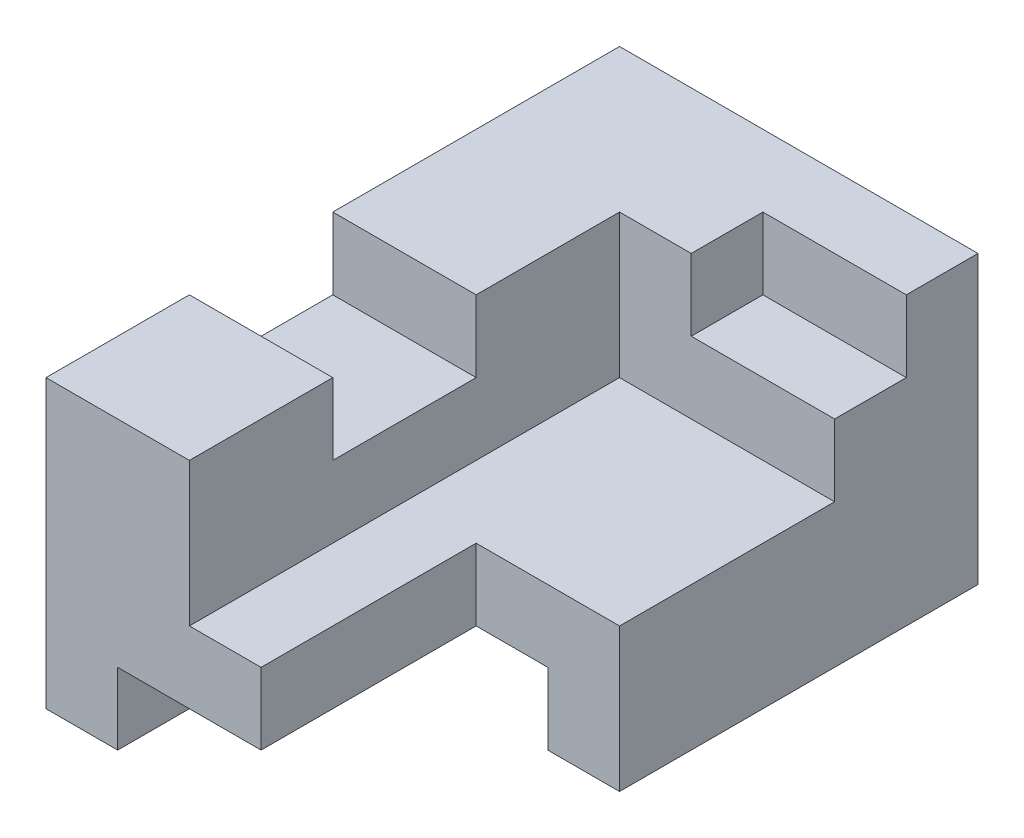
ISO-10303-21;
HEADER;
FILE_DESCRIPTION(('STEP AP214'),'2;1');
FILE_NAME('part.step','',(''),(''),'','','');
FILE_SCHEMA(('AUTOMOTIVE_DESIGN { 1 0 10303 214 1 1 1 1 }'));
ENDSEC;
DATA;
#1=APPLICATION_CONTEXT('core data for automotive mechanical design processes');
#2=APPLICATION_PROTOCOL_DEFINITION('international standard','automotive_design',2000,#1);
#3=PRODUCT_CONTEXT('',#1,'mechanical');
#4=PRODUCT('Part','Part','',(#3));
#5=PRODUCT_RELATED_PRODUCT_CATEGORY('part','',(#4));
#6=PRODUCT_DEFINITION_FORMATION('','',#4);
#7=PRODUCT_DEFINITION_CONTEXT('part definition',#1,'design');
#8=PRODUCT_DEFINITION('design','',#6,#7);
#9=PRODUCT_DEFINITION_SHAPE('','',#8);
#10=(LENGTH_UNIT() NAMED_UNIT(*) SI_UNIT(.MILLI.,.METRE.));
#11=(NAMED_UNIT(*) PLANE_ANGLE_UNIT() SI_UNIT($,.RADIAN.));
#12=(NAMED_UNIT(*) SI_UNIT($,.STERADIAN.) SOLID_ANGLE_UNIT());
#13=UNCERTAINTY_MEASURE_WITH_UNIT(LENGTH_MEASURE(1.E-05),#10,'distance_accuracy_value','');
#14=(GEOMETRIC_REPRESENTATION_CONTEXT(3) GLOBAL_UNCERTAINTY_ASSIGNED_CONTEXT((#13)) GLOBAL_UNIT_ASSIGNED_CONTEXT((#10,
#11,#12)) REPRESENTATION_CONTEXT('',''));
#15=CARTESIAN_POINT('',(0.,0.,0.));
#16=DIRECTION('',(0.,0.,1.));
#17=DIRECTION('',(1.,0.,0.));
#18=AXIS2_PLACEMENT_3D('',#15,#16,#17);
#19=CARTESIAN_POINT('',(2.5,-2.,8.));
#20=DIRECTION('',(0.,1.,0.));
#21=DIRECTION('',(0.,0.,1.));
#22=AXIS2_PLACEMENT_3D('',#19,#20,#21);
#23=PLANE('',#22);
#24=DIRECTION('',(1.,0.,0.));
#25=VECTOR('',#24,1.);
#26=CARTESIAN_POINT('',(2.5,-2.,0.));
#27=LINE('',#26,#25);
#28=CARTESIAN_POINT('',(-2.5,-2.,0.));
#29=VERTEX_POINT('',#28);
#30=CARTESIAN_POINT('',(-1.5,-2.,0.));
#31=VERTEX_POINT('',#30);
#32=EDGE_CURVE('E187',#29,#31,#27,.T.);
#33=ORIENTED_EDGE('',*,*,#32,.T.);
#34=DIRECTION('',(0.,0.,1.));
#35=VECTOR('',#34,1.);
#36=CARTESIAN_POINT('',(-1.5,-2.,0.));
#37=LINE('',#36,#35);
#38=CARTESIAN_POINT('',(-1.5,-2.,8.));
#39=VERTEX_POINT('',#38);
#40=EDGE_CURVE('E171',#31,#39,#37,.T.);
#41=ORIENTED_EDGE('',*,*,#40,.T.);
#42=DIRECTION('',(1.,0.,0.));
#43=VECTOR('',#42,1.);
#44=CARTESIAN_POINT('',(2.5,-2.,8.));
#45=LINE('',#44,#43);
#46=CARTESIAN_POINT('',(-2.5,-2.,8.));
#47=VERTEX_POINT('',#46);
#48=EDGE_CURVE('E311',#47,#39,#45,.T.);
#49=ORIENTED_EDGE('',*,*,#48,.F.);
#50=DIRECTION('',(0.,0.,-1.));
#51=VECTOR('',#50,1.);
#52=CARTESIAN_POINT('',(-2.5,-2.,8.));
#53=LINE('',#52,#51);
#54=EDGE_CURVE('E195',#47,#29,#53,.T.);
#55=ORIENTED_EDGE('',*,*,#54,.T.);
#56=EDGE_LOOP('',(#33,#41,#49,#55));
#57=FACE_BOUND('',#56,.T.);
#58=ADVANCED_FACE('F33',(#57),#23,.F.);
#59=CARTESIAN_POINT('',(2.5,2.,8.));
#60=DIRECTION('',(0.,-1.,0.));
#61=DIRECTION('',(1.,0.,0.));
#62=AXIS2_PLACEMENT_3D('',#59,#60,#61);
#63=PLANE('',#62);
#64=DIRECTION('',(-1.,0.,0.));
#65=VECTOR('',#64,1.);
#66=CARTESIAN_POINT('',(2.5,2.,8.));
#67=LINE('',#66,#65);
#68=CARTESIAN_POINT('',(-0.5,2.,8.));
#69=VERTEX_POINT('',#68);
#70=CARTESIAN_POINT('',(-2.5,2.,8.));
#71=VERTEX_POINT('',#70);
#72=EDGE_CURVE('E312',#69,#71,#67,.T.);
#73=ORIENTED_EDGE('',*,*,#72,.F.);
#74=DIRECTION('',(0.,0.,1.));
#75=VECTOR('',#74,1.);
#76=CARTESIAN_POINT('',(-0.5,2.,8.11275251675703));
#77=LINE('',#76,#75);
#78=CARTESIAN_POINT('',(-0.5,2.,6.));
#79=VERTEX_POINT('',#78);
#80=EDGE_CURVE('E246',#79,#69,#77,.T.);
#81=ORIENTED_EDGE('',*,*,#80,.F.);
#82=DIRECTION('',(1.,0.,0.));
#83=VECTOR('',#82,1.);
#84=CARTESIAN_POINT('',(-0.5,2.,6.));
#85=LINE('',#84,#83);
#86=CARTESIAN_POINT('',(-2.5,2.,6.));
#87=VERTEX_POINT('',#86);
#88=EDGE_CURVE('E279',#87,#79,#85,.T.);
#89=ORIENTED_EDGE('',*,*,#88,.F.);
#90=DIRECTION('',(0.,0.,-1.));
#91=VECTOR('',#90,1.);
#92=CARTESIAN_POINT('',(-2.5,2.,8.));
#93=LINE('',#92,#91);
#94=EDGE_CURVE('E210',#71,#87,#93,.T.);
#95=ORIENTED_EDGE('',*,*,#94,.F.);
#96=EDGE_LOOP('',(#73,#81,#89,#95));
#97=FACE_BOUND('',#96,.T.);
#98=ADVANCED_FACE('F362',(#97),#63,.F.);
#99=CARTESIAN_POINT('',(-2.5,-2.,8.));
#100=DIRECTION('',(1.,0.,0.));
#101=DIRECTION('',(0.,0.,-1.));
#102=AXIS2_PLACEMENT_3D('',#99,#100,#101);
#103=PLANE('',#102);
#104=DIRECTION('',(0.,0.,1.));
#105=VECTOR('',#104,1.);
#106=CARTESIAN_POINT('',(-2.5,1.,6.));
#107=LINE('',#106,#105);
#108=CARTESIAN_POINT('',(-2.5,1.,4.));
#109=VERTEX_POINT('',#108);
#110=CARTESIAN_POINT('',(-2.5,1.,6.));
#111=VERTEX_POINT('',#110);
#112=EDGE_CURVE('E283',#109,#111,#107,.T.);
#113=ORIENTED_EDGE('',*,*,#112,.F.);
#114=DIRECTION('',(0.,1.,0.));
#115=VECTOR('',#114,1.);
#116=CARTESIAN_POINT('',(-2.5,1.,4.));
#117=LINE('',#116,#115);
#118=CARTESIAN_POINT('',(-2.5,2.,4.));
#119=VERTEX_POINT('',#118);
#120=EDGE_CURVE('E300',#109,#119,#117,.T.);
#121=ORIENTED_EDGE('',*,*,#120,.T.);
#122=CARTESIAN_POINT('',(-2.5,2.,0.));
#123=VERTEX_POINT('',#122);
#124=EDGE_CURVE('E214',#119,#123,#93,.T.);
#125=ORIENTED_EDGE('',*,*,#124,.T.);
#126=DIRECTION('',(0.,-1.,0.));
#127=VECTOR('',#126,1.);
#128=CARTESIAN_POINT('',(-2.5,-2.,0.));
#129=LINE('',#128,#127);
#130=EDGE_CURVE('E203',#123,#29,#129,.T.);
#131=ORIENTED_EDGE('',*,*,#130,.T.);
#132=ORIENTED_EDGE('',*,*,#54,.F.);
#133=DIRECTION('',(0.,-1.,0.));
#134=VECTOR('',#133,1.);
#135=CARTESIAN_POINT('',(-2.5,-2.,8.));
#136=LINE('',#135,#134);
#137=EDGE_CURVE('E209',#71,#47,#136,.T.);
#138=ORIENTED_EDGE('',*,*,#137,.F.);
#139=ORIENTED_EDGE('',*,*,#94,.T.);
#140=DIRECTION('',(0.,1.,0.));
#141=VECTOR('',#140,1.);
#142=CARTESIAN_POINT('',(-2.5,1.,6.));
#143=LINE('',#142,#141);
#144=EDGE_CURVE('E296',#111,#87,#143,.T.);
#145=ORIENTED_EDGE('',*,*,#144,.F.);
#146=EDGE_LOOP('',(#113,#121,#125,#131,#132,#138,#139,#145));
#147=FACE_BOUND('',#146,.T.);
#148=ADVANCED_FACE('F35',(#147),#103,.F.);
#149=DIRECTION('',(-1.,0.,0.));
#150=VECTOR('',#149,1.);
#151=CARTESIAN_POINT('',(2.5,-2.,5.));
#152=LINE('',#151,#150);
#153=CARTESIAN_POINT('',(2.5,-2.,5.));
#154=VERTEX_POINT('',#153);
#155=CARTESIAN_POINT('',(1.5,-2.,5.));
#156=VERTEX_POINT('',#155);
#157=EDGE_CURVE('E225',#154,#156,#152,.T.);
#158=ORIENTED_EDGE('',*,*,#157,.T.);
#159=DIRECTION('',(0.,0.,1.));
#160=VECTOR('',#159,1.);
#161=CARTESIAN_POINT('',(1.5,-2.,0.));
#162=LINE('',#161,#160);
#163=CARTESIAN_POINT('',(1.5,-2.,0.));
#164=VERTEX_POINT('',#163);
#165=EDGE_CURVE('E48',#164,#156,#162,.T.);
#166=ORIENTED_EDGE('',*,*,#165,.F.);
#167=CARTESIAN_POINT('',(2.5,-2.,0.));
#168=VERTEX_POINT('',#167);
#169=EDGE_CURVE('E198',#164,#168,#27,.T.);
#170=ORIENTED_EDGE('',*,*,#169,.T.);
#171=DIRECTION('',(0.,0.,-1.));
#172=VECTOR('',#171,1.);
#173=CARTESIAN_POINT('',(2.5,-2.,8.));
#174=LINE('',#173,#172);
#175=EDGE_CURVE('E216',#154,#168,#174,.T.);
#176=ORIENTED_EDGE('',*,*,#175,.F.);
#177=EDGE_LOOP('',(#158,#166,#170,#176));
#178=FACE_BOUND('',#177,.T.);
#179=ADVANCED_FACE('F229',(#178),#23,.F.);
#180=CARTESIAN_POINT('',(2.5,-2.,8.));
#181=DIRECTION('',(-1.,0.,0.));
#182=DIRECTION('',(0.,0.,1.));
#183=AXIS2_PLACEMENT_3D('',#180,#181,#182);
#184=PLANE('',#183);
#185=DIRECTION('',(0.,0.,-1.));
#186=VECTOR('',#185,1.);
#187=CARTESIAN_POINT('',(2.5,0.,8.11275251675703));
#188=LINE('',#187,#186);
#189=CARTESIAN_POINT('',(2.5,0.,5.));
#190=VERTEX_POINT('',#189);
#191=CARTESIAN_POINT('',(2.5,0.,2.));
#192=VERTEX_POINT('',#191);
#193=EDGE_CURVE('E231',#190,#192,#188,.T.);
#194=ORIENTED_EDGE('',*,*,#193,.F.);
#195=DIRECTION('',(0.,1.,0.));
#196=VECTOR('',#195,1.);
#197=CARTESIAN_POINT('',(2.5,-3.,5.));
#198=LINE('',#197,#196);
#199=EDGE_CURVE('E56',#154,#190,#198,.T.);
#200=ORIENTED_EDGE('',*,*,#199,.F.);
#201=ORIENTED_EDGE('',*,*,#175,.T.);
#202=DIRECTION('',(0.,1.,0.));
#203=VECTOR('',#202,1.);
#204=CARTESIAN_POINT('',(2.5,-2.,0.));
#205=LINE('',#204,#203);
#206=CARTESIAN_POINT('',(2.5,2.,0.));
#207=VERTEX_POINT('',#206);
#208=EDGE_CURVE('E197',#168,#207,#205,.T.);
#209=ORIENTED_EDGE('',*,*,#208,.T.);
#210=DIRECTION('',(0.,0.,-1.));
#211=VECTOR('',#210,1.);
#212=CARTESIAN_POINT('',(2.5,2.,8.));
#213=LINE('',#212,#211);
#214=CARTESIAN_POINT('',(2.5,2.,1.));
#215=VERTEX_POINT('',#214);
#216=EDGE_CURVE('E213',#215,#207,#213,.T.);
#217=ORIENTED_EDGE('',*,*,#216,.F.);
#218=DIRECTION('',(0.,1.,0.));
#219=VECTOR('',#218,1.);
#220=CARTESIAN_POINT('',(2.5,1.,1.));
#221=LINE('',#220,#219);
#222=CARTESIAN_POINT('',(2.5,1.,1.));
#223=VERTEX_POINT('',#222);
#224=EDGE_CURVE('E272',#223,#215,#221,.T.);
#225=ORIENTED_EDGE('',*,*,#224,.F.);
#226=DIRECTION('',(0.,0.,-1.));
#227=VECTOR('',#226,1.);
#228=CARTESIAN_POINT('',(2.5,1.,2.));
#229=LINE('',#228,#227);
#230=CARTESIAN_POINT('',(2.5,1.,2.));
#231=VERTEX_POINT('',#230);
#232=EDGE_CURVE('E259',#231,#223,#229,.T.);
#233=ORIENTED_EDGE('',*,*,#232,.F.);
#234=DIRECTION('',(0.,1.,0.));
#235=VECTOR('',#234,1.);
#236=CARTESIAN_POINT('',(2.5,0.,2.));
#237=LINE('',#236,#235);
#238=EDGE_CURVE('E234',#192,#231,#237,.T.);
#239=ORIENTED_EDGE('',*,*,#238,.F.);
#240=EDGE_LOOP('',(#194,#200,#201,#209,#217,#225,#233,#239));
#241=FACE_BOUND('',#240,.T.);
#242=ADVANCED_FACE('F330',(#241),#184,.F.);
#243=CARTESIAN_POINT('',(-0.5,2.,2.));
#244=VERTEX_POINT('',#243);
#245=CARTESIAN_POINT('',(-0.5,2.,4.));
#246=VERTEX_POINT('',#245);
#247=EDGE_CURVE('E247',#244,#246,#77,.T.);
#248=ORIENTED_EDGE('',*,*,#247,.F.);
#249=DIRECTION('',(1.,0.,0.));
#250=VECTOR('',#249,1.);
#251=CARTESIAN_POINT('',(-0.5,2.,2.));
#252=LINE('',#251,#250);
#253=CARTESIAN_POINT('',(0.5,2.,2.));
#254=VERTEX_POINT('',#253);
#255=EDGE_CURVE('E251',#244,#254,#252,.T.);
#256=ORIENTED_EDGE('',*,*,#255,.T.);
#257=DIRECTION('',(0.,0.,1.));
#258=VECTOR('',#257,1.);
#259=CARTESIAN_POINT('',(0.499999999999999,2.,1.));
#260=LINE('',#259,#258);
#261=CARTESIAN_POINT('',(0.499999999999999,2.,1.));
#262=VERTEX_POINT('',#261);
#263=EDGE_CURVE('E263',#262,#254,#260,.T.);
#264=ORIENTED_EDGE('',*,*,#263,.F.);
#265=DIRECTION('',(-1.,0.,0.));
#266=VECTOR('',#265,1.);
#267=CARTESIAN_POINT('',(2.5,2.,1.));
#268=LINE('',#267,#266);
#269=EDGE_CURVE('E258',#215,#262,#268,.T.);
#270=ORIENTED_EDGE('',*,*,#269,.F.);
#271=ORIENTED_EDGE('',*,*,#216,.T.);
#272=DIRECTION('',(-1.,0.,0.));
#273=VECTOR('',#272,1.);
#274=CARTESIAN_POINT('',(2.5,2.,0.));
#275=LINE('',#274,#273);
#276=EDGE_CURVE('E201',#207,#123,#275,.T.);
#277=ORIENTED_EDGE('',*,*,#276,.T.);
#278=ORIENTED_EDGE('',*,*,#124,.F.);
#279=DIRECTION('',(-1.,0.,0.));
#280=VECTOR('',#279,1.);
#281=CARTESIAN_POINT('',(-0.500000000000001,2.,4.));
#282=LINE('',#281,#280);
#283=EDGE_CURVE('E287',#246,#119,#282,.T.);
#284=ORIENTED_EDGE('',*,*,#283,.F.);
#285=EDGE_LOOP('',(#248,#256,#264,#270,#271,#277,#278,#284));
#286=FACE_BOUND('',#285,.T.);
#287=ADVANCED_FACE('F324',(#286),#63,.F.);
#288=CARTESIAN_POINT('',(0.,0.,8.));
#289=DIRECTION('',(0.,0.,1.));
#290=DIRECTION('',(1.,0.,0.));
#291=AXIS2_PLACEMENT_3D('',#288,#289,#290);
#292=PLANE('',#291);
#293=DIRECTION('',(0.,-1.,0.));
#294=VECTOR('',#293,1.);
#295=CARTESIAN_POINT('',(-1.5,-2.,8.));
#296=LINE('',#295,#294);
#297=CARTESIAN_POINT('',(-1.5,-1.,8.));
#298=VERTEX_POINT('',#297);
#299=EDGE_CURVE('E178',#298,#39,#296,.T.);
#300=ORIENTED_EDGE('',*,*,#299,.F.);
#301=DIRECTION('',(-1.,0.,0.));
#302=VECTOR('',#301,1.);
#303=CARTESIAN_POINT('',(-1.5,-1.,8.));
#304=LINE('',#303,#302);
#305=CARTESIAN_POINT('',(0.5,-1.,8.));
#306=VERTEX_POINT('',#305);
#307=EDGE_CURVE('E192',#306,#298,#304,.T.);
#308=ORIENTED_EDGE('',*,*,#307,.F.);
#309=DIRECTION('',(0.,1.,0.));
#310=VECTOR('',#309,1.);
#311=CARTESIAN_POINT('',(0.5,-3.,8.));
#312=LINE('',#311,#310);
#313=CARTESIAN_POINT('',(0.5,0.,8.));
#314=VERTEX_POINT('',#313);
#315=EDGE_CURVE('E232',#306,#314,#312,.T.);
#316=ORIENTED_EDGE('',*,*,#315,.T.);
#317=DIRECTION('',(1.,0.,0.));
#318=VECTOR('',#317,1.);
#319=CARTESIAN_POINT('',(0.,0.,8.));
#320=LINE('',#319,#318);
#321=CARTESIAN_POINT('',(-0.5,0.,8.));
#322=VERTEX_POINT('',#321);
#323=EDGE_CURVE('E220',#322,#314,#320,.T.);
#324=ORIENTED_EDGE('',*,*,#323,.F.);
#325=DIRECTION('',(0.,-1.,0.));
#326=VECTOR('',#325,1.);
#327=CARTESIAN_POINT('',(-0.5,0.,8.));
#328=LINE('',#327,#326);
#329=EDGE_CURVE('E254',#69,#322,#328,.T.);
#330=ORIENTED_EDGE('',*,*,#329,.F.);
#331=ORIENTED_EDGE('',*,*,#72,.T.);
#332=ORIENTED_EDGE('',*,*,#137,.T.);
#333=ORIENTED_EDGE('',*,*,#48,.T.);
#334=EDGE_LOOP('',(#300,#308,#316,#324,#330,#331,#332,#333));
#335=FACE_BOUND('',#334,.T.);
#336=ADVANCED_FACE('F357',(#335),#292,.T.);
#337=CARTESIAN_POINT('',(0.,0.,0.));
#338=DIRECTION('',(0.,0.,1.));
#339=DIRECTION('',(1.,0.,0.));
#340=AXIS2_PLACEMENT_3D('',#337,#338,#339);
#341=PLANE('',#340);
#342=DIRECTION('',(-1.,0.,0.));
#343=VECTOR('',#342,1.);
#344=CARTESIAN_POINT('',(-1.5,-1.,0.));
#345=LINE('',#344,#343);
#346=CARTESIAN_POINT('',(1.5,-1.,0.));
#347=VERTEX_POINT('',#346);
#348=CARTESIAN_POINT('',(-1.5,-1.,0.));
#349=VERTEX_POINT('',#348);
#350=EDGE_CURVE('E182',#347,#349,#345,.T.);
#351=ORIENTED_EDGE('',*,*,#350,.T.);
#352=DIRECTION('',(0.,-1.,0.));
#353=VECTOR('',#352,1.);
#354=CARTESIAN_POINT('',(-1.5,-2.,0.));
#355=LINE('',#354,#353);
#356=EDGE_CURVE('E175',#349,#31,#355,.T.);
#357=ORIENTED_EDGE('',*,*,#356,.T.);
#358=ORIENTED_EDGE('',*,*,#32,.F.);
#359=ORIENTED_EDGE('',*,*,#130,.F.);
#360=ORIENTED_EDGE('',*,*,#276,.F.);
#361=ORIENTED_EDGE('',*,*,#208,.F.);
#362=ORIENTED_EDGE('',*,*,#169,.F.);
#363=DIRECTION('',(0.,1.,0.));
#364=VECTOR('',#363,1.);
#365=CARTESIAN_POINT('',(1.5,-2.,0.));
#366=LINE('',#365,#364);
#367=EDGE_CURVE('E191',#164,#347,#366,.T.);
#368=ORIENTED_EDGE('',*,*,#367,.T.);
#369=EDGE_LOOP('',(#351,#357,#358,#359,#360,#361,#362,#368));
#370=FACE_BOUND('',#369,.T.);
#371=ADVANCED_FACE('F185',(#370),#341,.F.);
#372=CARTESIAN_POINT('',(-0.500000000000001,1.,4.));
#373=DIRECTION('',(0.,0.,-1.));
#374=DIRECTION('',(-1.,0.,0.));
#375=AXIS2_PLACEMENT_3D('',#372,#373,#374);
#376=PLANE('',#375);
#377=ORIENTED_EDGE('',*,*,#283,.T.);
#378=ORIENTED_EDGE('',*,*,#120,.F.);
#379=DIRECTION('',(-1.,0.,0.));
#380=VECTOR('',#379,1.);
#381=CARTESIAN_POINT('',(-0.500000000000001,1.,4.));
#382=LINE('',#381,#380);
#383=CARTESIAN_POINT('',(-0.5,1.,4.));
#384=VERTEX_POINT('',#383);
#385=EDGE_CURVE('E293',#384,#109,#382,.T.);
#386=ORIENTED_EDGE('',*,*,#385,.F.);
#387=DIRECTION('',(0.,1.,0.));
#388=VECTOR('',#387,1.);
#389=CARTESIAN_POINT('',(-0.500000000000001,1.,4.));
#390=LINE('',#389,#388);
#391=EDGE_CURVE('E303',#384,#246,#390,.T.);
#392=ORIENTED_EDGE('',*,*,#391,.T.);
#393=EDGE_LOOP('',(#377,#378,#386,#392));
#394=FACE_BOUND('',#393,.T.);
#395=ADVANCED_FACE('F371',(#394),#376,.F.);
#396=CARTESIAN_POINT('',(-0.5,1.,6.));
#397=DIRECTION('',(0.,0.,1.));
#398=DIRECTION('',(1.,0.,0.));
#399=AXIS2_PLACEMENT_3D('',#396,#397,#398);
#400=PLANE('',#399);
#401=ORIENTED_EDGE('',*,*,#88,.T.);
#402=DIRECTION('',(0.,1.,0.));
#403=VECTOR('',#402,1.);
#404=CARTESIAN_POINT('',(-0.5,1.,6.));
#405=LINE('',#404,#403);
#406=CARTESIAN_POINT('',(-0.5,1.,6.));
#407=VERTEX_POINT('',#406);
#408=EDGE_CURVE('E306',#407,#79,#405,.T.);
#409=ORIENTED_EDGE('',*,*,#408,.F.);
#410=DIRECTION('',(1.,0.,0.));
#411=VECTOR('',#410,1.);
#412=CARTESIAN_POINT('',(-0.5,1.,6.));
#413=LINE('',#412,#411);
#414=EDGE_CURVE('E286',#111,#407,#413,.T.);
#415=ORIENTED_EDGE('',*,*,#414,.F.);
#416=ORIENTED_EDGE('',*,*,#144,.T.);
#417=EDGE_LOOP('',(#401,#409,#415,#416));
#418=FACE_BOUND('',#417,.T.);
#419=ADVANCED_FACE('F366',(#418),#400,.F.);
#420=CARTESIAN_POINT('',(0.,1.,0.));
#421=DIRECTION('',(0.,1.,0.));
#422=DIRECTION('',(-1.,0.,0.));
#423=AXIS2_PLACEMENT_3D('',#420,#421,#422);
#424=PLANE('',#423);
#425=ORIENTED_EDGE('',*,*,#112,.T.);
#426=ORIENTED_EDGE('',*,*,#414,.T.);
#427=DIRECTION('',(0.,0.,-1.));
#428=VECTOR('',#427,1.);
#429=CARTESIAN_POINT('',(-0.500000000000001,1.,4.));
#430=LINE('',#429,#428);
#431=EDGE_CURVE('E290',#407,#384,#430,.T.);
#432=ORIENTED_EDGE('',*,*,#431,.T.);
#433=ORIENTED_EDGE('',*,*,#385,.T.);
#434=EDGE_LOOP('',(#425,#426,#432,#433));
#435=FACE_BOUND('',#434,.T.);
#436=ADVANCED_FACE('F368',(#435),#424,.T.);
#437=CARTESIAN_POINT('',(0.499999999999999,1.,1.));
#438=DIRECTION('',(-1.,0.,0.));
#439=DIRECTION('',(0.,0.,1.));
#440=AXIS2_PLACEMENT_3D('',#437,#438,#439);
#441=PLANE('',#440);
#442=ORIENTED_EDGE('',*,*,#263,.T.);
#443=DIRECTION('',(0.,1.,0.));
#444=VECTOR('',#443,1.);
#445=CARTESIAN_POINT('',(0.5,1.,2.));
#446=LINE('',#445,#444);
#447=CARTESIAN_POINT('',(0.499999999999999,1.,2.));
#448=VERTEX_POINT('',#447);
#449=EDGE_CURVE('E277',#448,#254,#446,.T.);
#450=ORIENTED_EDGE('',*,*,#449,.F.);
#451=DIRECTION('',(0.,0.,1.));
#452=VECTOR('',#451,1.);
#453=CARTESIAN_POINT('',(0.499999999999999,1.,1.));
#454=LINE('',#453,#452);
#455=CARTESIAN_POINT('',(0.499999999999999,1.,1.));
#456=VERTEX_POINT('',#455);
#457=EDGE_CURVE('E266',#456,#448,#454,.T.);
#458=ORIENTED_EDGE('',*,*,#457,.F.);
#459=DIRECTION('',(0.,1.,0.));
#460=VECTOR('',#459,1.);
#461=CARTESIAN_POINT('',(0.499999999999999,1.,1.));
#462=LINE('',#461,#460);
#463=EDGE_CURVE('E280',#456,#262,#462,.T.);
#464=ORIENTED_EDGE('',*,*,#463,.T.);
#465=EDGE_LOOP('',(#442,#450,#458,#464));
#466=FACE_BOUND('',#465,.T.);
#467=ADVANCED_FACE('F383',(#466),#441,.F.);
#468=CARTESIAN_POINT('',(2.5,1.,1.));
#469=DIRECTION('',(0.,0.,-1.));
#470=DIRECTION('',(-1.,0.,0.));
#471=AXIS2_PLACEMENT_3D('',#468,#469,#470);
#472=PLANE('',#471);
#473=ORIENTED_EDGE('',*,*,#269,.T.);
#474=ORIENTED_EDGE('',*,*,#463,.F.);
#475=DIRECTION('',(-1.,0.,0.));
#476=VECTOR('',#475,1.);
#477=CARTESIAN_POINT('',(2.5,1.,1.));
#478=LINE('',#477,#476);
#479=EDGE_CURVE('E262',#223,#456,#478,.T.);
#480=ORIENTED_EDGE('',*,*,#479,.F.);
#481=ORIENTED_EDGE('',*,*,#224,.T.);
#482=EDGE_LOOP('',(#473,#474,#480,#481));
#483=FACE_BOUND('',#482,.T.);
#484=ADVANCED_FACE('F388',(#483),#472,.F.);
#485=CARTESIAN_POINT('',(0.,1.,0.));
#486=DIRECTION('',(0.,1.,0.));
#487=DIRECTION('',(0.,0.,1.));
#488=AXIS2_PLACEMENT_3D('',#485,#486,#487);
#489=PLANE('',#488);
#490=ORIENTED_EDGE('',*,*,#232,.T.);
#491=ORIENTED_EDGE('',*,*,#479,.T.);
#492=ORIENTED_EDGE('',*,*,#457,.T.);
#493=DIRECTION('',(1.,0.,0.));
#494=VECTOR('',#493,1.);
#495=CARTESIAN_POINT('',(0.5,1.,2.));
#496=LINE('',#495,#494);
#497=EDGE_CURVE('E269',#448,#231,#496,.T.);
#498=ORIENTED_EDGE('',*,*,#497,.T.);
#499=EDGE_LOOP('',(#490,#491,#492,#498));
#500=FACE_BOUND('',#499,.T.);
#501=ADVANCED_FACE('F385',(#500),#489,.T.);
#502=CARTESIAN_POINT('',(-0.5,0.,0.));
#503=DIRECTION('',(-1.,0.,0.));
#504=DIRECTION('',(0.,0.,1.));
#505=AXIS2_PLACEMENT_3D('',#502,#503,#504);
#506=PLANE('',#505);
#507=ORIENTED_EDGE('',*,*,#329,.T.);
#508=DIRECTION('',(0.,0.,-1.));
#509=VECTOR('',#508,1.);
#510=CARTESIAN_POINT('',(-0.5,0.,8.11275251675703));
#511=LINE('',#510,#509);
#512=CARTESIAN_POINT('',(-0.5,0.,2.));
#513=VERTEX_POINT('',#512);
#514=EDGE_CURVE('E241',#322,#513,#511,.T.);
#515=ORIENTED_EDGE('',*,*,#514,.T.);
#516=DIRECTION('',(0.,1.,0.));
#517=VECTOR('',#516,1.);
#518=CARTESIAN_POINT('',(-0.5,0.,2.));
#519=LINE('',#518,#517);
#520=EDGE_CURVE('E243',#513,#244,#519,.T.);
#521=ORIENTED_EDGE('',*,*,#520,.T.);
#522=ORIENTED_EDGE('',*,*,#247,.T.);
#523=ORIENTED_EDGE('',*,*,#391,.F.);
#524=ORIENTED_EDGE('',*,*,#431,.F.);
#525=ORIENTED_EDGE('',*,*,#408,.T.);
#526=ORIENTED_EDGE('',*,*,#80,.T.);
#527=EDGE_LOOP('',(#507,#515,#521,#522,#523,#524,#525,#526));
#528=FACE_BOUND('',#527,.T.);
#529=ADVANCED_FACE('F374',(#528),#506,.F.);
#530=CARTESIAN_POINT('',(-0.5,0.,2.));
#531=DIRECTION('',(0.,0.,-1.));
#532=DIRECTION('',(-1.,0.,0.));
#533=AXIS2_PLACEMENT_3D('',#530,#531,#532);
#534=PLANE('',#533);
#535=ORIENTED_EDGE('',*,*,#255,.F.);
#536=ORIENTED_EDGE('',*,*,#520,.F.);
#537=DIRECTION('',(1.,0.,0.));
#538=VECTOR('',#537,1.);
#539=CARTESIAN_POINT('',(-0.5,0.,2.));
#540=LINE('',#539,#538);
#541=EDGE_CURVE('E248',#513,#192,#540,.T.);
#542=ORIENTED_EDGE('',*,*,#541,.T.);
#543=ORIENTED_EDGE('',*,*,#238,.T.);
#544=ORIENTED_EDGE('',*,*,#497,.F.);
#545=ORIENTED_EDGE('',*,*,#449,.T.);
#546=EDGE_LOOP('',(#535,#536,#542,#543,#544,#545));
#547=FACE_BOUND('',#546,.T.);
#548=ADVANCED_FACE('F379',(#547),#534,.F.);
#549=CARTESIAN_POINT('',(-0.5,0.,8.11275251675703));
#550=DIRECTION('',(0.,-1.,0.));
#551=DIRECTION('',(0.,0.,-1.));
#552=AXIS2_PLACEMENT_3D('',#549,#550,#551);
#553=PLANE('',#552);
#554=ORIENTED_EDGE('',*,*,#323,.T.);
#555=DIRECTION('',(0.,0.,1.));
#556=VECTOR('',#555,1.);
#557=CARTESIAN_POINT('',(0.5,0.,8.));
#558=LINE('',#557,#556);
#559=CARTESIAN_POINT('',(0.5,0.,5.));
#560=VERTEX_POINT('',#559);
#561=EDGE_CURVE('E333',#560,#314,#558,.T.);
#562=ORIENTED_EDGE('',*,*,#561,.F.);
#563=DIRECTION('',(-1.,0.,0.));
#564=VECTOR('',#563,1.);
#565=CARTESIAN_POINT('',(2.5,0.,5.));
#566=LINE('',#565,#564);
#567=EDGE_CURVE('E335',#190,#560,#566,.T.);
#568=ORIENTED_EDGE('',*,*,#567,.F.);
#569=ORIENTED_EDGE('',*,*,#193,.T.);
#570=ORIENTED_EDGE('',*,*,#541,.F.);
#571=ORIENTED_EDGE('',*,*,#514,.F.);
#572=EDGE_LOOP('',(#554,#562,#568,#569,#570,#571));
#573=FACE_BOUND('',#572,.T.);
#574=ADVANCED_FACE('F481',(#573),#553,.F.);
#575=CARTESIAN_POINT('',(0.5,-3.,8.));
#576=DIRECTION('',(-1.,0.,0.));
#577=DIRECTION('',(0.,0.,1.));
#578=AXIS2_PLACEMENT_3D('',#575,#576,#577);
#579=PLANE('',#578);
#580=ORIENTED_EDGE('',*,*,#315,.F.);
#581=DIRECTION('',(0.,0.,-1.));
#582=VECTOR('',#581,1.);
#583=CARTESIAN_POINT('',(0.5,-1.,8.));
#584=LINE('',#583,#582);
#585=CARTESIAN_POINT('',(0.5,-1.,5.));
#586=VERTEX_POINT('',#585);
#587=EDGE_CURVE('E340',#306,#586,#584,.T.);
#588=ORIENTED_EDGE('',*,*,#587,.T.);
#589=DIRECTION('',(0.,1.,0.));
#590=VECTOR('',#589,1.);
#591=CARTESIAN_POINT('',(0.5,-3.,5.));
#592=LINE('',#591,#590);
#593=EDGE_CURVE('E236',#586,#560,#592,.T.);
#594=ORIENTED_EDGE('',*,*,#593,.T.);
#595=ORIENTED_EDGE('',*,*,#561,.T.);
#596=EDGE_LOOP('',(#580,#588,#594,#595));
#597=FACE_BOUND('',#596,.T.);
#598=ADVANCED_FACE('F495',(#597),#579,.F.);
#599=CARTESIAN_POINT('',(2.5,-3.,5.));
#600=DIRECTION('',(0.,0.,-1.));
#601=DIRECTION('',(-1.,0.,0.));
#602=AXIS2_PLACEMENT_3D('',#599,#600,#601);
#603=PLANE('',#602);
#604=ORIENTED_EDGE('',*,*,#593,.F.);
#605=DIRECTION('',(1.,0.,0.));
#606=VECTOR('',#605,1.);
#607=CARTESIAN_POINT('',(2.5,-1.,5.));
#608=LINE('',#607,#606);
#609=CARTESIAN_POINT('',(1.5,-1.,5.));
#610=VERTEX_POINT('',#609);
#611=EDGE_CURVE('E11',#586,#610,#608,.T.);
#612=ORIENTED_EDGE('',*,*,#611,.T.);
#613=DIRECTION('',(0.,-1.,0.));
#614=VECTOR('',#613,1.);
#615=CARTESIAN_POINT('',(1.5,-3.,5.));
#616=LINE('',#615,#614);
#617=EDGE_CURVE('E41',#610,#156,#616,.T.);
#618=ORIENTED_EDGE('',*,*,#617,.T.);
#619=ORIENTED_EDGE('',*,*,#157,.F.);
#620=ORIENTED_EDGE('',*,*,#199,.T.);
#621=ORIENTED_EDGE('',*,*,#567,.T.);
#622=EDGE_LOOP('',(#604,#612,#618,#619,#620,#621));
#623=FACE_BOUND('',#622,.T.);
#624=ADVANCED_FACE('F224',(#623),#603,.F.);
#625=CARTESIAN_POINT('',(-1.5,-1.,0.));
#626=DIRECTION('',(0.,1.,0.));
#627=DIRECTION('',(0.,0.,1.));
#628=AXIS2_PLACEMENT_3D('',#625,#626,#627);
#629=PLANE('',#628);
#630=ORIENTED_EDGE('',*,*,#307,.T.);
#631=DIRECTION('',(0.,0.,1.));
#632=VECTOR('',#631,1.);
#633=CARTESIAN_POINT('',(-1.5,-1.,0.));
#634=LINE('',#633,#632);
#635=EDGE_CURVE('E344',#349,#298,#634,.T.);
#636=ORIENTED_EDGE('',*,*,#635,.F.);
#637=ORIENTED_EDGE('',*,*,#350,.F.);
#638=DIRECTION('',(0.,0.,1.));
#639=VECTOR('',#638,1.);
#640=CARTESIAN_POINT('',(1.5,-1.,0.));
#641=LINE('',#640,#639);
#642=EDGE_CURVE('E347',#347,#610,#641,.T.);
#643=ORIENTED_EDGE('',*,*,#642,.T.);
#644=ORIENTED_EDGE('',*,*,#611,.F.);
#645=ORIENTED_EDGE('',*,*,#587,.F.);
#646=EDGE_LOOP('',(#630,#636,#637,#643,#644,#645));
#647=FACE_BOUND('',#646,.T.);
#648=ADVANCED_FACE('F355',(#647),#629,.F.);
#649=CARTESIAN_POINT('',(1.5,-2.,0.));
#650=DIRECTION('',(1.,0.,0.));
#651=DIRECTION('',(0.,0.,-1.));
#652=AXIS2_PLACEMENT_3D('',#649,#650,#651);
#653=PLANE('',#652);
#654=ORIENTED_EDGE('',*,*,#642,.F.);
#655=ORIENTED_EDGE('',*,*,#367,.F.);
#656=ORIENTED_EDGE('',*,*,#165,.T.);
#657=ORIENTED_EDGE('',*,*,#617,.F.);
#658=EDGE_LOOP('',(#654,#655,#656,#657));
#659=FACE_BOUND('',#658,.T.);
#660=ADVANCED_FACE('F353',(#659),#653,.F.);
#661=CARTESIAN_POINT('',(-1.5,-2.,0.));
#662=DIRECTION('',(-1.,0.,0.));
#663=DIRECTION('',(0.,0.,1.));
#664=AXIS2_PLACEMENT_3D('',#661,#662,#663);
#665=PLANE('',#664);
#666=ORIENTED_EDGE('',*,*,#299,.T.);
#667=ORIENTED_EDGE('',*,*,#40,.F.);
#668=ORIENTED_EDGE('',*,*,#356,.F.);
#669=ORIENTED_EDGE('',*,*,#635,.T.);
#670=EDGE_LOOP('',(#666,#667,#668,#669));
#671=FACE_BOUND('',#670,.T.);
#672=ADVANCED_FACE('F173',(#671),#665,.F.);
#673=CLOSED_SHELL('',(#58,#98,#148,#179,#242,#287,#336,#371,#395,#419,#436,#467,#484,#501,#529,
#548,#574,#598,#624,#648,#660,#672));
#674=MANIFOLD_SOLID_BREP('B2',#673);
#675=ADVANCED_BREP_SHAPE_REPRESENTATION('',(#18,#674),#14);
#676=SHAPE_DEFINITION_REPRESENTATION(#9,#675);
ENDSEC;
END-ISO-10303-21;
